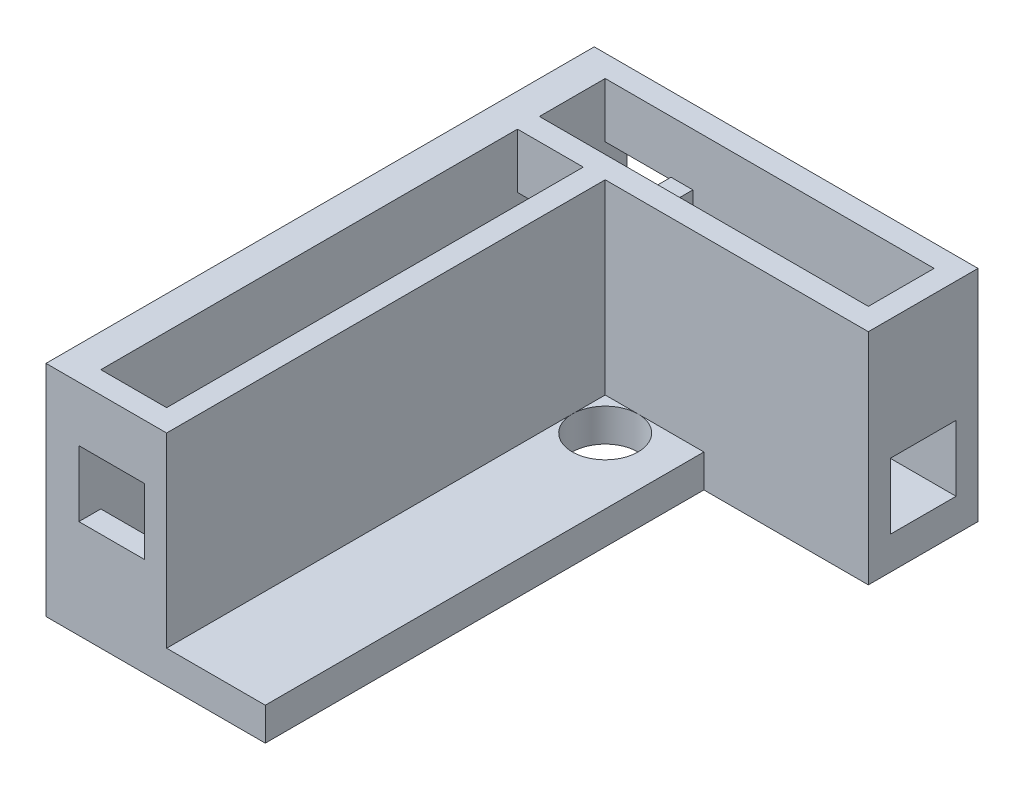
ISO-10303-21;
HEADER;
FILE_DESCRIPTION(('STEP AP214'),'2;1');
FILE_NAME('part.step','',(''),(''),'','','');
FILE_SCHEMA(('AUTOMOTIVE_DESIGN { 1 0 10303 214 1 1 1 1 }'));
ENDSEC;
DATA;
#1=APPLICATION_CONTEXT('core data for automotive mechanical design processes');
#2=APPLICATION_PROTOCOL_DEFINITION('international standard','automotive_design',2000,#1);
#3=PRODUCT_CONTEXT('',#1,'mechanical');
#4=PRODUCT('Part','Part','',(#3));
#5=PRODUCT_RELATED_PRODUCT_CATEGORY('part','',(#4));
#6=PRODUCT_DEFINITION_FORMATION('','',#4);
#7=PRODUCT_DEFINITION_CONTEXT('part definition',#1,'design');
#8=PRODUCT_DEFINITION('design','',#6,#7);
#9=PRODUCT_DEFINITION_SHAPE('','',#8);
#10=(LENGTH_UNIT() NAMED_UNIT(*) SI_UNIT(.MILLI.,.METRE.));
#11=(NAMED_UNIT(*) PLANE_ANGLE_UNIT() SI_UNIT($,.RADIAN.));
#12=(NAMED_UNIT(*) SI_UNIT($,.STERADIAN.) SOLID_ANGLE_UNIT());
#13=UNCERTAINTY_MEASURE_WITH_UNIT(LENGTH_MEASURE(1.E-05),#10,'distance_accuracy_value','');
#14=(GEOMETRIC_REPRESENTATION_CONTEXT(3) GLOBAL_UNCERTAINTY_ASSIGNED_CONTEXT((#13)) GLOBAL_UNIT_ASSIGNED_CONTEXT((#10,
#11,#12)) REPRESENTATION_CONTEXT('',''));
#15=CARTESIAN_POINT('',(0.,0.,0.));
#16=DIRECTION('',(0.,0.,1.));
#17=DIRECTION('',(1.,0.,0.));
#18=AXIS2_PLACEMENT_3D('',#15,#16,#17);
#19=CARTESIAN_POINT('',(35.,2.,10.));
#20=DIRECTION('',(0.,-1.,0.));
#21=DIRECTION('',(0.,0.,1.));
#22=AXIS2_PLACEMENT_3D('',#19,#20,#21);
#23=PLANE('',#22);
#24=DIRECTION('',(1.,0.,0.));
#25=VECTOR('',#24,1.);
#26=CARTESIAN_POINT('',(35.,2.,10.));
#27=LINE('',#26,#25);
#28=CARTESIAN_POINT('',(11.,2.,10.));
#29=VERTEX_POINT('',#28);
#30=CARTESIAN_POINT('',(14.,2.,10.));
#31=VERTEX_POINT('',#30);
#32=EDGE_CURVE('E287',#29,#31,#27,.T.);
#33=ORIENTED_EDGE('',*,*,#32,.F.);
#34=DIRECTION('',(0.,0.,-1.));
#35=VECTOR('',#34,1.);
#36=CARTESIAN_POINT('',(11.,2.,10.));
#37=LINE('',#36,#35);
#38=CARTESIAN_POINT('',(11.,2.,13.));
#39=VERTEX_POINT('',#38);
#40=EDGE_CURVE('E277',#39,#29,#37,.T.);
#41=ORIENTED_EDGE('',*,*,#40,.F.);
#42=CARTESIAN_POINT('',(14.,2.,13.));
#43=DIRECTION('',(0.,-1.,0.));
#44=DIRECTION('',(0.,0.,-1.));
#45=AXIS2_PLACEMENT_3D('',#42,#43,#44);
#46=CIRCLE('',#45,3.);
#47=EDGE_CURVE('E270',#39,#31,#46,.T.);
#48=ORIENTED_EDGE('',*,*,#47,.T.);
#49=EDGE_LOOP('',(#33,#41,#48));
#50=FACE_BOUND('',#49,.T.);
#51=ADVANCED_FACE('F34',(#50),#23,.F.);
#52=CARTESIAN_POINT('',(3.00000000000001,8.,19.3532580399902));
#53=DIRECTION('',(1.,0.,0.));
#54=DIRECTION('',(0.,0.,1.));
#55=AXIS2_PLACEMENT_3D('',#52,#53,#54);
#56=PLANE('',#55);
#57=DIRECTION('',(0.,-1.,0.));
#58=VECTOR('',#57,1.);
#59=CARTESIAN_POINT('',(3.00000000000001,14.2,50.));
#60=LINE('',#59,#58);
#61=CARTESIAN_POINT('',(3.00000000000001,14.,50.));
#62=VERTEX_POINT('',#61);
#63=CARTESIAN_POINT('',(3.00000000000001,8.,50.));
#64=VERTEX_POINT('',#63);
#65=EDGE_CURVE('E530',#62,#64,#60,.T.);
#66=ORIENTED_EDGE('',*,*,#65,.T.);
#67=DIRECTION('',(0.,0.,-1.));
#68=VECTOR('',#67,1.);
#69=CARTESIAN_POINT('',(3.00000000000001,8.,19.3532580399902));
#70=LINE('',#69,#68);
#71=CARTESIAN_POINT('',(3.00000000000001,8.,48.));
#72=VERTEX_POINT('',#71);
#73=EDGE_CURVE('E520',#64,#72,#70,.T.);
#74=ORIENTED_EDGE('',*,*,#73,.T.);
#75=DIRECTION('',(0.,-1.,0.));
#76=VECTOR('',#75,1.);
#77=CARTESIAN_POINT('',(3.00000000000001,8.,48.));
#78=LINE('',#77,#76);
#79=CARTESIAN_POINT('',(3.00000000000001,2.,48.));
#80=VERTEX_POINT('',#79);
#81=EDGE_CURVE('E422',#72,#80,#78,.T.);
#82=ORIENTED_EDGE('',*,*,#81,.T.);
#83=DIRECTION('',(0.,0.,-1.));
#84=VECTOR('',#83,1.);
#85=CARTESIAN_POINT('',(3.00000000000001,2.,10.));
#86=LINE('',#85,#84);
#87=CARTESIAN_POINT('',(3.00000000000001,2.,10.));
#88=VERTEX_POINT('',#87);
#89=EDGE_CURVE('E294',#80,#88,#86,.T.);
#90=ORIENTED_EDGE('',*,*,#89,.T.);
#91=DIRECTION('',(0.,-1.,0.));
#92=VECTOR('',#91,1.);
#93=CARTESIAN_POINT('',(3.00000000000001,8.,10.));
#94=LINE('',#93,#92);
#95=CARTESIAN_POINT('',(3.00000000000001,8.,10.));
#96=VERTEX_POINT('',#95);
#97=EDGE_CURVE('E288',#96,#88,#94,.T.);
#98=ORIENTED_EDGE('',*,*,#97,.F.);
#99=CARTESIAN_POINT('',(3.00000000000001,8.,8.));
#100=VERTEX_POINT('',#99);
#101=EDGE_CURVE('E523',#96,#100,#70,.T.);
#102=ORIENTED_EDGE('',*,*,#101,.T.);
#103=CARTESIAN_POINT('',(3.00000000000001,8.,1.99999999999999));
#104=VERTEX_POINT('',#103);
#105=EDGE_CURVE('E566',#100,#104,#70,.T.);
#106=ORIENTED_EDGE('',*,*,#105,.T.);
#107=CARTESIAN_POINT('',(3.00000000000001,8.,0.));
#108=VERTEX_POINT('',#107);
#109=EDGE_CURVE('E524',#104,#108,#70,.T.);
#110=ORIENTED_EDGE('',*,*,#109,.T.);
#111=DIRECTION('',(0.,-1.,0.));
#112=VECTOR('',#111,1.);
#113=CARTESIAN_POINT('',(3.00000000000001,14.2,0.));
#114=LINE('',#113,#112);
#115=CARTESIAN_POINT('',(3.00000000000001,14.,0.));
#116=VERTEX_POINT('',#115);
#117=EDGE_CURVE('E527',#116,#108,#114,.T.);
#118=ORIENTED_EDGE('',*,*,#117,.F.);
#119=DIRECTION('',(0.,0.,-1.));
#120=VECTOR('',#119,1.);
#121=CARTESIAN_POINT('',(3.00000000000001,14.,19.3532580399902));
#122=LINE('',#121,#120);
#123=CARTESIAN_POINT('',(3.00000000000001,14.,2.));
#124=VERTEX_POINT('',#123);
#125=EDGE_CURVE('E515',#124,#116,#122,.T.);
#126=ORIENTED_EDGE('',*,*,#125,.F.);
#127=DIRECTION('',(0.,-1.,0.));
#128=VECTOR('',#127,1.);
#129=CARTESIAN_POINT('',(3.00000000000001,19.,2.));
#130=LINE('',#129,#128);
#131=CARTESIAN_POINT('',(3.00000000000001,19.,2.));
#132=VERTEX_POINT('',#131);
#133=EDGE_CURVE('E490',#132,#124,#130,.T.);
#134=ORIENTED_EDGE('',*,*,#133,.F.);
#135=DIRECTION('',(0.,0.,-1.));
#136=VECTOR('',#135,1.);
#137=CARTESIAN_POINT('',(3.00000000000001,19.,19.3532580399902));
#138=LINE('',#137,#136);
#139=CARTESIAN_POINT('',(3.00000000000001,19.,8.));
#140=VERTEX_POINT('',#139);
#141=EDGE_CURVE('E463',#140,#132,#138,.T.);
#142=ORIENTED_EDGE('',*,*,#141,.F.);
#143=DIRECTION('',(0.,-1.,0.));
#144=VECTOR('',#143,1.);
#145=CARTESIAN_POINT('',(3.00000000000001,19.,8.));
#146=LINE('',#145,#144);
#147=CARTESIAN_POINT('',(3.00000000000001,14.,8.));
#148=VERTEX_POINT('',#147);
#149=EDGE_CURVE('E493',#140,#148,#146,.T.);
#150=ORIENTED_EDGE('',*,*,#149,.T.);
#151=CARTESIAN_POINT('',(3.00000000000001,14.,10.));
#152=VERTEX_POINT('',#151);
#153=EDGE_CURVE('E518',#152,#148,#122,.T.);
#154=ORIENTED_EDGE('',*,*,#153,.F.);
#155=DIRECTION('',(0.,-1.,0.));
#156=VECTOR('',#155,1.);
#157=CARTESIAN_POINT('',(3.00000000000001,19.,10.));
#158=LINE('',#157,#156);
#159=CARTESIAN_POINT('',(3.00000000000001,19.,10.));
#160=VERTEX_POINT('',#159);
#161=EDGE_CURVE('E477',#160,#152,#158,.T.);
#162=ORIENTED_EDGE('',*,*,#161,.F.);
#163=DIRECTION('',(0.,0.,-1.));
#164=VECTOR('',#163,1.);
#165=CARTESIAN_POINT('',(3.00000000000001,19.,19.3532580399902));
#166=LINE('',#165,#164);
#167=CARTESIAN_POINT('',(3.00000000000001,19.,48.));
#168=VERTEX_POINT('',#167);
#169=EDGE_CURVE('E489',#168,#160,#166,.T.);
#170=ORIENTED_EDGE('',*,*,#169,.F.);
#171=DIRECTION('',(0.,-1.,0.));
#172=VECTOR('',#171,1.);
#173=CARTESIAN_POINT('',(3.00000000000001,19.,48.));
#174=LINE('',#173,#172);
#175=CARTESIAN_POINT('',(3.00000000000001,14.,48.));
#176=VERTEX_POINT('',#175);
#177=EDGE_CURVE('E494',#168,#176,#174,.T.);
#178=ORIENTED_EDGE('',*,*,#177,.T.);
#179=EDGE_CURVE('E519',#62,#176,#122,.T.);
#180=ORIENTED_EDGE('',*,*,#179,.F.);
#181=EDGE_LOOP('',(#66,#74,#82,#90,#98,#102,#106,#110,#118,#126,#134,#142,#150,#154,#162,#170,
#178,#180));
#182=FACE_BOUND('',#181,.T.);
#183=ADVANCED_FACE('F434',(#182),#56,.T.);
#184=CARTESIAN_POINT('',(9.00000000000001,8.,19.3532580399902));
#185=DIRECTION('',(1.,0.,0.));
#186=DIRECTION('',(0.,0.,1.));
#187=AXIS2_PLACEMENT_3D('',#184,#185,#186);
#188=PLANE('',#187);
#189=DIRECTION('',(0.,0.,-1.));
#190=VECTOR('',#189,1.);
#191=CARTESIAN_POINT('',(9.00000000000001,14.2,19.3532580399902));
#192=LINE('',#191,#190);
#193=CARTESIAN_POINT('',(9.00000000000001,14.2,8.));
#194=VERTEX_POINT('',#193);
#195=CARTESIAN_POINT('',(9.00000000000001,14.2,2.));
#196=VERTEX_POINT('',#195);
#197=EDGE_CURVE('E383',#194,#196,#192,.T.);
#198=ORIENTED_EDGE('',*,*,#197,.T.);
#199=DIRECTION('',(0.,-1.,0.));
#200=VECTOR('',#199,1.);
#201=CARTESIAN_POINT('',(9.00000000000001,8.,1.99999999999999));
#202=LINE('',#201,#200);
#203=CARTESIAN_POINT('',(9.00000000000001,14.,2.));
#204=VERTEX_POINT('',#203);
#205=EDGE_CURVE('E378',#196,#204,#202,.T.);
#206=ORIENTED_EDGE('',*,*,#205,.T.);
#207=DIRECTION('',(0.,0.,-1.));
#208=VECTOR('',#207,1.);
#209=CARTESIAN_POINT('',(9.00000000000001,14.,19.3532580399902));
#210=LINE('',#209,#208);
#211=CARTESIAN_POINT('',(9.00000000000001,14.,0.));
#212=VERTEX_POINT('',#211);
#213=EDGE_CURVE('E510',#204,#212,#210,.T.);
#214=ORIENTED_EDGE('',*,*,#213,.T.);
#215=DIRECTION('',(0.,-1.,0.));
#216=VECTOR('',#215,1.);
#217=CARTESIAN_POINT('',(9.00000000000001,14.2,0.));
#218=LINE('',#217,#216);
#219=CARTESIAN_POINT('',(9.00000000000001,8.,0.));
#220=VERTEX_POINT('',#219);
#221=EDGE_CURVE('E404',#212,#220,#218,.T.);
#222=ORIENTED_EDGE('',*,*,#221,.T.);
#223=DIRECTION('',(0.,0.,-1.));
#224=VECTOR('',#223,1.);
#225=CARTESIAN_POINT('',(9.00000000000001,8.,19.3532580399902));
#226=LINE('',#225,#224);
#227=CARTESIAN_POINT('',(9.00000000000001,8.,2.));
#228=VERTEX_POINT('',#227);
#229=EDGE_CURVE('E543',#228,#220,#226,.T.);
#230=ORIENTED_EDGE('',*,*,#229,.F.);
#231=CARTESIAN_POINT('',(9.00000000000001,8.,8.));
#232=VERTEX_POINT('',#231);
#233=EDGE_CURVE('E655',#232,#228,#226,.T.);
#234=ORIENTED_EDGE('',*,*,#233,.F.);
#235=CARTESIAN_POINT('',(9.00000000000001,8.,10.));
#236=VERTEX_POINT('',#235);
#237=EDGE_CURVE('E546',#236,#232,#226,.T.);
#238=ORIENTED_EDGE('',*,*,#237,.F.);
#239=DIRECTION('',(0.,-1.,0.));
#240=VECTOR('',#239,1.);
#241=CARTESIAN_POINT('',(9.00000000000001,8.,10.));
#242=LINE('',#241,#240);
#243=CARTESIAN_POINT('',(9.00000000000001,2.,10.));
#244=VERTEX_POINT('',#243);
#245=EDGE_CURVE('E416',#236,#244,#242,.T.);
#246=ORIENTED_EDGE('',*,*,#245,.T.);
#247=DIRECTION('',(0.,0.,-1.));
#248=VECTOR('',#247,1.);
#249=CARTESIAN_POINT('',(9.00000000000001,2.,10.));
#250=LINE('',#249,#248);
#251=CARTESIAN_POINT('',(9.,2.,48.));
#252=VERTEX_POINT('',#251);
#253=EDGE_CURVE('E282',#252,#244,#250,.T.);
#254=ORIENTED_EDGE('',*,*,#253,.F.);
#255=DIRECTION('',(0.,-1.,0.));
#256=VECTOR('',#255,1.);
#257=CARTESIAN_POINT('',(9.00000000000001,8.,48.));
#258=LINE('',#257,#256);
#259=CARTESIAN_POINT('',(9.00000000000001,8.,48.));
#260=VERTEX_POINT('',#259);
#261=EDGE_CURVE('E419',#260,#252,#258,.T.);
#262=ORIENTED_EDGE('',*,*,#261,.F.);
#263=CARTESIAN_POINT('',(9.00000000000001,8.,50.));
#264=VERTEX_POINT('',#263);
#265=EDGE_CURVE('E388',#264,#260,#226,.T.);
#266=ORIENTED_EDGE('',*,*,#265,.F.);
#267=DIRECTION('',(0.,-1.,0.));
#268=VECTOR('',#267,1.);
#269=CARTESIAN_POINT('',(9.00000000000001,14.2,50.));
#270=LINE('',#269,#268);
#271=CARTESIAN_POINT('',(9.00000000000001,14.,50.));
#272=VERTEX_POINT('',#271);
#273=EDGE_CURVE('E408',#272,#264,#270,.T.);
#274=ORIENTED_EDGE('',*,*,#273,.F.);
#275=CARTESIAN_POINT('',(9.00000000000001,14.,48.));
#276=VERTEX_POINT('',#275);
#277=EDGE_CURVE('E514',#272,#276,#210,.T.);
#278=ORIENTED_EDGE('',*,*,#277,.T.);
#279=DIRECTION('',(0.,-1.,0.));
#280=VECTOR('',#279,1.);
#281=CARTESIAN_POINT('',(9.00000000000001,19.,48.));
#282=LINE('',#281,#280);
#283=CARTESIAN_POINT('',(9.00000000000001,19.,48.));
#284=VERTEX_POINT('',#283);
#285=EDGE_CURVE('E502',#284,#276,#282,.T.);
#286=ORIENTED_EDGE('',*,*,#285,.F.);
#287=DIRECTION('',(0.,0.,-1.));
#288=VECTOR('',#287,1.);
#289=CARTESIAN_POINT('',(9.00000000000001,19.,19.3532580399902));
#290=LINE('',#289,#288);
#291=CARTESIAN_POINT('',(9.00000000000001,19.,10.));
#292=VERTEX_POINT('',#291);
#293=EDGE_CURVE('E722',#284,#292,#290,.T.);
#294=ORIENTED_EDGE('',*,*,#293,.T.);
#295=DIRECTION('',(0.,-1.,0.));
#296=VECTOR('',#295,1.);
#297=CARTESIAN_POINT('',(9.00000000000001,19.,10.));
#298=LINE('',#297,#296);
#299=CARTESIAN_POINT('',(9.00000000000001,14.,10.));
#300=VERTEX_POINT('',#299);
#301=EDGE_CURVE('E499',#292,#300,#298,.T.);
#302=ORIENTED_EDGE('',*,*,#301,.T.);
#303=CARTESIAN_POINT('',(9.00000000000001,14.,8.));
#304=VERTEX_POINT('',#303);
#305=EDGE_CURVE('E513',#300,#304,#210,.T.);
#306=ORIENTED_EDGE('',*,*,#305,.T.);
#307=DIRECTION('',(0.,-1.,0.));
#308=VECTOR('',#307,1.);
#309=CARTESIAN_POINT('',(9.00000000000001,8.,8.));
#310=LINE('',#309,#308);
#311=EDGE_CURVE('E507',#194,#304,#310,.T.);
#312=ORIENTED_EDGE('',*,*,#311,.F.);
#313=EDGE_LOOP('',(#198,#206,#214,#222,#230,#234,#238,#246,#254,#262,#266,#274,#278,#286,#294,
#302,#306,#312));
#314=FACE_BOUND('',#313,.T.);
#315=ADVANCED_FACE('F559',(#314),#188,.F.);
#316=CARTESIAN_POINT('',(-55.6237513405793,8.,19.3532580399902));
#317=DIRECTION('',(0.,1.,0.));
#318=DIRECTION('',(0.,0.,-1.));
#319=AXIS2_PLACEMENT_3D('',#316,#317,#318);
#320=PLANE('',#319);
#321=ORIENTED_EDGE('',*,*,#101,.F.);
#322=DIRECTION('',(1.,0.,0.));
#323=VECTOR('',#322,1.);
#324=CARTESIAN_POINT('',(-55.6237513405793,8.,10.));
#325=LINE('',#324,#323);
#326=EDGE_CURVE('E301',#96,#236,#325,.T.);
#327=ORIENTED_EDGE('',*,*,#326,.T.);
#328=ORIENTED_EDGE('',*,*,#237,.T.);
#329=DIRECTION('',(-1.,0.,0.));
#330=VECTOR('',#329,1.);
#331=CARTESIAN_POINT('',(-55.6237513405793,8.,7.99999999999999));
#332=LINE('',#331,#330);
#333=EDGE_CURVE('E297',#232,#100,#332,.T.);
#334=ORIENTED_EDGE('',*,*,#333,.T.);
#335=EDGE_LOOP('',(#321,#327,#328,#334));
#336=FACE_BOUND('',#335,.T.);
#337=ADVANCED_FACE('F661',(#336),#320,.T.);
#338=CARTESIAN_POINT('',(-55.6237513405793,8.,19.3532580399902));
#339=DIRECTION('',(0.,1.,0.));
#340=DIRECTION('',(0.,0.,-1.));
#341=AXIS2_PLACEMENT_3D('',#338,#339,#340);
#342=PLANE('',#341);
#343=ORIENTED_EDGE('',*,*,#109,.F.);
#344=DIRECTION('',(-1.,0.,0.));
#345=VECTOR('',#344,1.);
#346=CARTESIAN_POINT('',(-55.6237513405793,8.,1.99999999999999));
#347=LINE('',#346,#345);
#348=EDGE_CURVE('E314',#228,#104,#347,.T.);
#349=ORIENTED_EDGE('',*,*,#348,.F.);
#350=ORIENTED_EDGE('',*,*,#229,.T.);
#351=DIRECTION('',(1.,0.,0.));
#352=VECTOR('',#351,1.);
#353=CARTESIAN_POINT('',(-55.6237513405793,8.,0.));
#354=LINE('',#353,#352);
#355=EDGE_CURVE('E312',#108,#220,#354,.T.);
#356=ORIENTED_EDGE('',*,*,#355,.F.);
#357=EDGE_LOOP('',(#343,#349,#350,#356));
#358=FACE_BOUND('',#357,.T.);
#359=ADVANCED_FACE('F653',(#358),#342,.T.);
#360=ORIENTED_EDGE('',*,*,#73,.F.);
#361=DIRECTION('',(1.,0.,0.));
#362=VECTOR('',#361,1.);
#363=CARTESIAN_POINT('',(-55.6237513405793,8.,50.));
#364=LINE('',#363,#362);
#365=EDGE_CURVE('E410',#64,#264,#364,.T.);
#366=ORIENTED_EDGE('',*,*,#365,.T.);
#367=ORIENTED_EDGE('',*,*,#265,.T.);
#368=DIRECTION('',(1.,0.,0.));
#369=VECTOR('',#368,1.);
#370=CARTESIAN_POINT('',(-55.6237513405793,8.,48.));
#371=LINE('',#370,#369);
#372=EDGE_CURVE('E412',#72,#260,#371,.T.);
#373=ORIENTED_EDGE('',*,*,#372,.F.);
#374=EDGE_LOOP('',(#360,#366,#367,#373));
#375=FACE_BOUND('',#374,.T.);
#376=ADVANCED_FACE('F561',(#375),#320,.T.);
#377=CARTESIAN_POINT('',(11.,2.,50.));
#378=VERTEX_POINT('',#377);
#379=EDGE_CURVE('E265',#378,#39,#37,.T.);
#380=ORIENTED_EDGE('',*,*,#379,.F.);
#381=DIRECTION('',(1.,0.,0.));
#382=VECTOR('',#381,1.);
#383=CARTESIAN_POINT('',(0.,2.,50.));
#384=LINE('',#383,#382);
#385=CARTESIAN_POINT('',(20.,2.,50.));
#386=VERTEX_POINT('',#385);
#387=EDGE_CURVE('E328',#378,#386,#384,.T.);
#388=ORIENTED_EDGE('',*,*,#387,.T.);
#389=DIRECTION('',(0.,0.,-1.));
#390=VECTOR('',#389,1.);
#391=CARTESIAN_POINT('',(20.,2.,50.));
#392=LINE('',#391,#390);
#393=CARTESIAN_POINT('',(20.,2.,10.));
#394=VERTEX_POINT('',#393);
#395=EDGE_CURVE('E330',#386,#394,#392,.T.);
#396=ORIENTED_EDGE('',*,*,#395,.T.);
#397=EDGE_CURVE('E268',#31,#394,#27,.T.);
#398=ORIENTED_EDGE('',*,*,#397,.F.);
#399=EDGE_CURVE('E49',#31,#39,#46,.T.);
#400=ORIENTED_EDGE('',*,*,#399,.T.);
#401=EDGE_LOOP('',(#380,#388,#396,#398,#400));
#402=FACE_BOUND('',#401,.T.);
#403=ADVANCED_FACE('F263',(#402),#23,.F.);
#404=CARTESIAN_POINT('',(20.,-1.,10.));
#405=DIRECTION('',(0.,0.,-1.));
#406=DIRECTION('',(1.,0.,0.));
#407=AXIS2_PLACEMENT_3D('',#404,#405,#406);
#408=PLANE('',#407);
#409=EDGE_CURVE('E308',#88,#244,#27,.T.);
#410=ORIENTED_EDGE('',*,*,#409,.T.);
#411=ORIENTED_EDGE('',*,*,#245,.F.);
#412=ORIENTED_EDGE('',*,*,#326,.F.);
#413=ORIENTED_EDGE('',*,*,#97,.T.);
#414=EDGE_LOOP('',(#410,#411,#412,#413));
#415=FACE_BOUND('',#414,.T.);
#416=ADVANCED_FACE('F427',(#415),#408,.F.);
#417=DIRECTION('',(0.,0.,-1.));
#418=VECTOR('',#417,1.);
#419=CARTESIAN_POINT('',(35.,2.,10.));
#420=LINE('',#419,#418);
#421=CARTESIAN_POINT('',(35.,2.,8.));
#422=VERTEX_POINT('',#421);
#423=CARTESIAN_POINT('',(35.,2.,2.));
#424=VERTEX_POINT('',#423);
#425=EDGE_CURVE('E322',#422,#424,#420,.T.);
#426=ORIENTED_EDGE('',*,*,#425,.T.);
#427=DIRECTION('',(-1.,0.,0.));
#428=VECTOR('',#427,1.);
#429=CARTESIAN_POINT('',(35.,2.,2.));
#430=LINE('',#429,#428);
#431=CARTESIAN_POINT('',(0.,2.,1.99999999999999));
#432=VERTEX_POINT('',#431);
#433=EDGE_CURVE('E364',#424,#432,#430,.T.);
#434=ORIENTED_EDGE('',*,*,#433,.T.);
#435=DIRECTION('',(0.,0.,1.));
#436=VECTOR('',#435,1.);
#437=CARTESIAN_POINT('',(0.,2.,0.));
#438=LINE('',#437,#436);
#439=CARTESIAN_POINT('',(0.,2.,8.));
#440=VERTEX_POINT('',#439);
#441=EDGE_CURVE('E325',#432,#440,#438,.T.);
#442=ORIENTED_EDGE('',*,*,#441,.T.);
#443=DIRECTION('',(-1.,0.,0.));
#444=VECTOR('',#443,1.);
#445=CARTESIAN_POINT('',(35.,2.,8.));
#446=LINE('',#445,#444);
#447=EDGE_CURVE('E309',#422,#440,#446,.T.);
#448=ORIENTED_EDGE('',*,*,#447,.F.);
#449=EDGE_LOOP('',(#426,#434,#442,#448));
#450=FACE_BOUND('',#449,.T.);
#451=ADVANCED_FACE('F609',(#450),#23,.F.);
#452=DIRECTION('',(1.,0.,0.));
#453=VECTOR('',#452,1.);
#454=CARTESIAN_POINT('',(35.,2.,48.));
#455=LINE('',#454,#453);
#456=EDGE_CURVE('E367',#80,#252,#455,.T.);
#457=ORIENTED_EDGE('',*,*,#456,.T.);
#458=ORIENTED_EDGE('',*,*,#253,.T.);
#459=ORIENTED_EDGE('',*,*,#409,.F.);
#460=ORIENTED_EDGE('',*,*,#89,.F.);
#461=EDGE_LOOP('',(#457,#458,#459,#460));
#462=FACE_BOUND('',#461,.T.);
#463=ADVANCED_FACE('F438',(#462),#23,.F.);
#464=DIRECTION('',(1.,0.,0.));
#465=VECTOR('',#464,1.);
#466=CARTESIAN_POINT('',(-55.6237513405793,19.,10.));
#467=LINE('',#466,#465);
#468=CARTESIAN_POINT('',(11.,19.,10.));
#469=VERTEX_POINT('',#468);
#470=CARTESIAN_POINT('',(35.,19.,10.));
#471=VERTEX_POINT('',#470);
#472=EDGE_CURVE('E452',#469,#471,#467,.T.);
#473=ORIENTED_EDGE('',*,*,#472,.F.);
#474=DIRECTION('',(0.,-1.,0.));
#475=VECTOR('',#474,1.);
#476=CARTESIAN_POINT('',(11.,8.,10.));
#477=LINE('',#476,#475);
#478=EDGE_CURVE('E414',#469,#29,#477,.T.);
#479=ORIENTED_EDGE('',*,*,#478,.T.);
#480=ORIENTED_EDGE('',*,*,#32,.T.);
#481=ORIENTED_EDGE('',*,*,#397,.T.);
#482=DIRECTION('',(0.,1.,0.));
#483=VECTOR('',#482,1.);
#484=CARTESIAN_POINT('',(20.,-1.,10.));
#485=LINE('',#484,#483);
#486=CARTESIAN_POINT('',(20.,-1.,10.));
#487=VERTEX_POINT('',#486);
#488=EDGE_CURVE('E348',#487,#394,#485,.T.);
#489=ORIENTED_EDGE('',*,*,#488,.F.);
#490=DIRECTION('',(1.,0.,0.));
#491=VECTOR('',#490,1.);
#492=CARTESIAN_POINT('',(20.,-1.,10.));
#493=LINE('',#492,#491);
#494=CARTESIAN_POINT('',(35.,-1.,10.));
#495=VERTEX_POINT('',#494);
#496=EDGE_CURVE('E332',#487,#495,#493,.T.);
#497=ORIENTED_EDGE('',*,*,#496,.T.);
#498=DIRECTION('',(0.,1.,0.));
#499=VECTOR('',#498,1.);
#500=CARTESIAN_POINT('',(35.,-1.,10.));
#501=LINE('',#500,#499);
#502=EDGE_CURVE('E361',#495,#471,#501,.T.);
#503=ORIENTED_EDGE('',*,*,#502,.T.);
#504=EDGE_LOOP('',(#473,#479,#480,#481,#489,#497,#503));
#505=FACE_BOUND('',#504,.T.);
#506=ADVANCED_FACE('F36',(#505),#408,.F.);
#507=CARTESIAN_POINT('',(35.,-1.,10.));
#508=DIRECTION('',(-1.,0.,0.));
#509=DIRECTION('',(0.,0.,-1.));
#510=AXIS2_PLACEMENT_3D('',#507,#508,#509);
#511=PLANE('',#510);
#512=DIRECTION('',(0.,0.,-1.));
#513=VECTOR('',#512,1.);
#514=CARTESIAN_POINT('',(35.,19.,19.3532580399902));
#515=LINE('',#514,#513);
#516=CARTESIAN_POINT('',(35.,19.,0.));
#517=VERTEX_POINT('',#516);
#518=EDGE_CURVE('E460',#471,#517,#515,.T.);
#519=ORIENTED_EDGE('',*,*,#518,.F.);
#520=ORIENTED_EDGE('',*,*,#502,.F.);
#521=DIRECTION('',(0.,0.,-1.));
#522=VECTOR('',#521,1.);
#523=CARTESIAN_POINT('',(35.,-1.,10.));
#524=LINE('',#523,#522);
#525=CARTESIAN_POINT('',(35.,-1.,0.));
#526=VERTEX_POINT('',#525);
#527=EDGE_CURVE('E335',#495,#526,#524,.T.);
#528=ORIENTED_EDGE('',*,*,#527,.T.);
#529=DIRECTION('',(0.,1.,0.));
#530=VECTOR('',#529,1.);
#531=CARTESIAN_POINT('',(35.,-1.,0.));
#532=LINE('',#531,#530);
#533=EDGE_CURVE('E358',#526,#517,#532,.T.);
#534=ORIENTED_EDGE('',*,*,#533,.T.);
#535=EDGE_LOOP('',(#519,#520,#528,#534));
#536=FACE_BOUND('',#535,.T.);
#537=DIRECTION('',(0.,-1.,0.));
#538=VECTOR('',#537,1.);
#539=CARTESIAN_POINT('',(35.,8.,2.));
#540=LINE('',#539,#538);
#541=CARTESIAN_POINT('',(35.,8.,2.));
#542=VERTEX_POINT('',#541);
#543=EDGE_CURVE('E320',#542,#424,#540,.T.);
#544=ORIENTED_EDGE('',*,*,#543,.T.);
#545=ORIENTED_EDGE('',*,*,#425,.F.);
#546=DIRECTION('',(0.,-1.,0.));
#547=VECTOR('',#546,1.);
#548=CARTESIAN_POINT('',(35.,8.,8.));
#549=LINE('',#548,#547);
#550=CARTESIAN_POINT('',(35.,8.,8.));
#551=VERTEX_POINT('',#550);
#552=EDGE_CURVE('E305',#551,#422,#549,.T.);
#553=ORIENTED_EDGE('',*,*,#552,.F.);
#554=DIRECTION('',(0.,0.,-1.));
#555=VECTOR('',#554,1.);
#556=CARTESIAN_POINT('',(35.,8.,19.3532580399902));
#557=LINE('',#556,#555);
#558=EDGE_CURVE('E540',#551,#542,#557,.T.);
#559=ORIENTED_EDGE('',*,*,#558,.T.);
#560=EDGE_LOOP('',(#544,#545,#553,#559));
#561=FACE_BOUND('',#560,.T.);
#562=ADVANCED_FACE('F615',(#536,#561),#511,.F.);
#563=CARTESIAN_POINT('',(0.,-1.,0.));
#564=DIRECTION('',(0.,0.,-1.));
#565=DIRECTION('',(1.,0.,0.));
#566=AXIS2_PLACEMENT_3D('',#563,#564,#565);
#567=PLANE('',#566);
#568=DIRECTION('',(1.,0.,0.));
#569=VECTOR('',#568,1.);
#570=CARTESIAN_POINT('',(-55.6237513405793,14.,0.));
#571=LINE('',#570,#569);
#572=EDGE_CURVE('E483',#116,#212,#571,.T.);
#573=ORIENTED_EDGE('',*,*,#572,.F.);
#574=ORIENTED_EDGE('',*,*,#117,.T.);
#575=ORIENTED_EDGE('',*,*,#355,.T.);
#576=ORIENTED_EDGE('',*,*,#221,.F.);
#577=EDGE_LOOP('',(#573,#574,#575,#576));
#578=FACE_BOUND('',#577,.T.);
#579=DIRECTION('',(1.,0.,0.));
#580=VECTOR('',#579,1.);
#581=CARTESIAN_POINT('',(-55.6237513405793,19.,0.));
#582=LINE('',#581,#580);
#583=CARTESIAN_POINT('',(0.,19.,0.));
#584=VERTEX_POINT('',#583);
#585=EDGE_CURVE('E465',#584,#517,#582,.T.);
#586=ORIENTED_EDGE('',*,*,#585,.T.);
#587=ORIENTED_EDGE('',*,*,#533,.F.);
#588=DIRECTION('',(1.,0.,0.));
#589=VECTOR('',#588,1.);
#590=CARTESIAN_POINT('',(0.,-1.,0.));
#591=LINE('',#590,#589);
#592=CARTESIAN_POINT('',(0.,-1.,0.));
#593=VERTEX_POINT('',#592);
#594=EDGE_CURVE('E338',#593,#526,#591,.T.);
#595=ORIENTED_EDGE('',*,*,#594,.F.);
#596=DIRECTION('',(0.,1.,0.));
#597=VECTOR('',#596,1.);
#598=CARTESIAN_POINT('',(0.,-1.,0.));
#599=LINE('',#598,#597);
#600=EDGE_CURVE('E355',#593,#584,#599,.T.);
#601=ORIENTED_EDGE('',*,*,#600,.T.);
#602=EDGE_LOOP('',(#586,#587,#595,#601));
#603=FACE_BOUND('',#602,.T.);
#604=ADVANCED_FACE('F648',(#578,#603),#567,.T.);
#605=CARTESIAN_POINT('',(0.,-1.,0.));
#606=DIRECTION('',(1.,0.,0.));
#607=DIRECTION('',(0.,0.,1.));
#608=AXIS2_PLACEMENT_3D('',#605,#606,#607);
#609=PLANE('',#608);
#610=DIRECTION('',(0.,0.,1.));
#611=VECTOR('',#610,1.);
#612=CARTESIAN_POINT('',(0.,19.,19.3532580399902));
#613=LINE('',#612,#611);
#614=CARTESIAN_POINT('',(0.,19.,50.));
#615=VERTEX_POINT('',#614);
#616=EDGE_CURVE('E715',#584,#615,#613,.T.);
#617=ORIENTED_EDGE('',*,*,#616,.F.);
#618=ORIENTED_EDGE('',*,*,#600,.F.);
#619=DIRECTION('',(0.,0.,1.));
#620=VECTOR('',#619,1.);
#621=CARTESIAN_POINT('',(0.,-1.,0.));
#622=LINE('',#621,#620);
#623=CARTESIAN_POINT('',(0.,-1.,50.));
#624=VERTEX_POINT('',#623);
#625=EDGE_CURVE('E340',#593,#624,#622,.T.);
#626=ORIENTED_EDGE('',*,*,#625,.T.);
#627=DIRECTION('',(0.,1.,0.));
#628=VECTOR('',#627,1.);
#629=CARTESIAN_POINT('',(0.,-1.,50.));
#630=LINE('',#629,#628);
#631=EDGE_CURVE('E352',#624,#615,#630,.T.);
#632=ORIENTED_EDGE('',*,*,#631,.T.);
#633=EDGE_LOOP('',(#617,#618,#626,#632));
#634=FACE_BOUND('',#633,.T.);
#635=DIRECTION('',(0.,-1.,0.));
#636=VECTOR('',#635,1.);
#637=CARTESIAN_POINT('',(0.,8.,8.));
#638=LINE('',#637,#636);
#639=CARTESIAN_POINT('',(0.,8.,8.));
#640=VERTEX_POINT('',#639);
#641=EDGE_CURVE('E303',#640,#440,#638,.T.);
#642=ORIENTED_EDGE('',*,*,#641,.T.);
#643=ORIENTED_EDGE('',*,*,#441,.F.);
#644=DIRECTION('',(0.,-1.,0.));
#645=VECTOR('',#644,1.);
#646=CARTESIAN_POINT('',(0.,8.,1.99999999999999));
#647=LINE('',#646,#645);
#648=CARTESIAN_POINT('',(0.,8.,1.99999999999999));
#649=VERTEX_POINT('',#648);
#650=EDGE_CURVE('E318',#649,#432,#647,.T.);
#651=ORIENTED_EDGE('',*,*,#650,.F.);
#652=DIRECTION('',(0.,0.,1.));
#653=VECTOR('',#652,1.);
#654=CARTESIAN_POINT('',(0.,8.,19.3532580399902));
#655=LINE('',#654,#653);
#656=EDGE_CURVE('E522',#649,#640,#655,.T.);
#657=ORIENTED_EDGE('',*,*,#656,.T.);
#658=EDGE_LOOP('',(#642,#643,#651,#657));
#659=FACE_BOUND('',#658,.T.);
#660=ADVANCED_FACE('F632',(#634,#659),#609,.F.);
#661=CARTESIAN_POINT('',(0.,-1.,50.));
#662=DIRECTION('',(0.,0.,-1.));
#663=DIRECTION('',(1.,0.,0.));
#664=AXIS2_PLACEMENT_3D('',#661,#662,#663);
#665=PLANE('',#664);
#666=ORIENTED_EDGE('',*,*,#273,.T.);
#667=ORIENTED_EDGE('',*,*,#365,.F.);
#668=ORIENTED_EDGE('',*,*,#65,.F.);
#669=DIRECTION('',(1.,0.,0.));
#670=VECTOR('',#669,1.);
#671=CARTESIAN_POINT('',(-55.6237513405793,14.,50.));
#672=LINE('',#671,#670);
#673=EDGE_CURVE('E481',#62,#272,#672,.T.);
#674=ORIENTED_EDGE('',*,*,#673,.T.);
#675=EDGE_LOOP('',(#666,#667,#668,#674));
#676=FACE_BOUND('',#675,.T.);
#677=DIRECTION('',(0.,-1.,0.));
#678=VECTOR('',#677,1.);
#679=CARTESIAN_POINT('',(11.,8.,50.));
#680=LINE('',#679,#678);
#681=CARTESIAN_POINT('',(11.,19.,50.));
#682=VERTEX_POINT('',#681);
#683=EDGE_CURVE('E280',#682,#378,#680,.T.);
#684=ORIENTED_EDGE('',*,*,#683,.F.);
#685=DIRECTION('',(1.,0.,0.));
#686=VECTOR('',#685,1.);
#687=CARTESIAN_POINT('',(-55.6237513405793,19.,50.));
#688=LINE('',#687,#686);
#689=EDGE_CURVE('E716',#615,#682,#688,.T.);
#690=ORIENTED_EDGE('',*,*,#689,.F.);
#691=ORIENTED_EDGE('',*,*,#631,.F.);
#692=DIRECTION('',(1.,0.,0.));
#693=VECTOR('',#692,1.);
#694=CARTESIAN_POINT('',(0.,-1.,50.));
#695=LINE('',#694,#693);
#696=CARTESIAN_POINT('',(20.,-1.,50.));
#697=VERTEX_POINT('',#696);
#698=EDGE_CURVE('E343',#624,#697,#695,.T.);
#699=ORIENTED_EDGE('',*,*,#698,.T.);
#700=DIRECTION('',(0.,1.,0.));
#701=VECTOR('',#700,1.);
#702=CARTESIAN_POINT('',(20.,-1.,50.));
#703=LINE('',#702,#701);
#704=EDGE_CURVE('E350',#697,#386,#703,.T.);
#705=ORIENTED_EDGE('',*,*,#704,.T.);
#706=ORIENTED_EDGE('',*,*,#387,.F.);
#707=EDGE_LOOP('',(#684,#690,#691,#699,#705,#706));
#708=FACE_BOUND('',#707,.T.);
#709=ADVANCED_FACE('F552',(#676,#708),#665,.F.);
#710=CARTESIAN_POINT('',(20.,-1.,50.));
#711=DIRECTION('',(-1.,0.,0.));
#712=DIRECTION('',(0.,0.,-1.));
#713=AXIS2_PLACEMENT_3D('',#710,#711,#712);
#714=PLANE('',#713);
#715=ORIENTED_EDGE('',*,*,#704,.F.);
#716=DIRECTION('',(0.,0.,-1.));
#717=VECTOR('',#716,1.);
#718=CARTESIAN_POINT('',(20.,-1.,50.));
#719=LINE('',#718,#717);
#720=EDGE_CURVE('E346',#697,#487,#719,.T.);
#721=ORIENTED_EDGE('',*,*,#720,.T.);
#722=ORIENTED_EDGE('',*,*,#488,.T.);
#723=ORIENTED_EDGE('',*,*,#395,.F.);
#724=EDGE_LOOP('',(#715,#721,#722,#723));
#725=FACE_BOUND('',#724,.T.);
#726=ADVANCED_FACE('F446',(#725),#714,.F.);
#727=CARTESIAN_POINT('',(35.,-1.,10.));
#728=DIRECTION('',(0.,-1.,0.));
#729=DIRECTION('',(0.,0.,1.));
#730=AXIS2_PLACEMENT_3D('',#727,#728,#729);
#731=PLANE('',#730);
#732=CARTESIAN_POINT('',(14.,-1.,13.));
#733=DIRECTION('',(0.,1.,0.));
#734=DIRECTION('',(0.,0.,1.));
#735=AXIS2_PLACEMENT_3D('',#732,#733,#734);
#736=CIRCLE('',#735,3.);
#737=CARTESIAN_POINT('',(14.,-1.,16.));
#738=VERTEX_POINT('',#737);
#739=EDGE_CURVE('E38',#738,#738,#736,.T.);
#740=ORIENTED_EDGE('',*,*,#739,.T.);
#741=EDGE_LOOP('',(#740));
#742=FACE_BOUND('',#741,.T.);
#743=ORIENTED_EDGE('',*,*,#496,.F.);
#744=ORIENTED_EDGE('',*,*,#720,.F.);
#745=ORIENTED_EDGE('',*,*,#698,.F.);
#746=ORIENTED_EDGE('',*,*,#625,.F.);
#747=ORIENTED_EDGE('',*,*,#594,.T.);
#748=ORIENTED_EDGE('',*,*,#527,.F.);
#749=EDGE_LOOP('',(#743,#744,#745,#746,#747,#748));
#750=FACE_BOUND('',#749,.T.);
#751=ADVANCED_FACE('F449',(#742,#750),#731,.T.);
#752=CARTESIAN_POINT('',(-55.6237513405793,8.,1.99999999999999));
#753=DIRECTION('',(0.,0.,-1.));
#754=DIRECTION('',(1.,0.,0.));
#755=AXIS2_PLACEMENT_3D('',#752,#753,#754);
#756=PLANE('',#755);
#757=DIRECTION('',(0.,-1.,0.));
#758=VECTOR('',#757,1.);
#759=CARTESIAN_POINT('',(33.,14.2,2.));
#760=LINE('',#759,#758);
#761=CARTESIAN_POINT('',(33.,19.,2.));
#762=VERTEX_POINT('',#761);
#763=CARTESIAN_POINT('',(33.,8.,2.));
#764=VERTEX_POINT('',#763);
#765=EDGE_CURVE('E393',#762,#764,#760,.T.);
#766=ORIENTED_EDGE('',*,*,#765,.F.);
#767=DIRECTION('',(-1.,0.,0.));
#768=VECTOR('',#767,1.);
#769=CARTESIAN_POINT('',(-55.6237513405793,19.,1.99999999999999));
#770=LINE('',#769,#768);
#771=EDGE_CURVE('E475',#762,#132,#770,.T.);
#772=ORIENTED_EDGE('',*,*,#771,.T.);
#773=ORIENTED_EDGE('',*,*,#133,.T.);
#774=DIRECTION('',(-1.,0.,0.));
#775=VECTOR('',#774,1.);
#776=CARTESIAN_POINT('',(-55.6237513405793,14.,1.99999999999999));
#777=LINE('',#776,#775);
#778=EDGE_CURVE('E487',#204,#124,#777,.T.);
#779=ORIENTED_EDGE('',*,*,#778,.F.);
#780=ORIENTED_EDGE('',*,*,#205,.F.);
#781=DIRECTION('',(1.,0.,0.));
#782=VECTOR('',#781,1.);
#783=CARTESIAN_POINT('',(-55.6237513405793,14.2,1.99999999999999));
#784=LINE('',#783,#782);
#785=CARTESIAN_POINT('',(11.,14.2,2.));
#786=VERTEX_POINT('',#785);
#787=EDGE_CURVE('E43',#196,#786,#784,.T.);
#788=ORIENTED_EDGE('',*,*,#787,.T.);
#789=DIRECTION('',(0.,-1.,0.));
#790=VECTOR('',#789,1.);
#791=CARTESIAN_POINT('',(11.,14.2,2.));
#792=LINE('',#791,#790);
#793=CARTESIAN_POINT('',(11.,8.,2.));
#794=VERTEX_POINT('',#793);
#795=EDGE_CURVE('E376',#786,#794,#792,.T.);
#796=ORIENTED_EDGE('',*,*,#795,.T.);
#797=DIRECTION('',(-1.,0.,0.));
#798=VECTOR('',#797,1.);
#799=CARTESIAN_POINT('',(-55.6237513405793,8.,1.99999999999999));
#800=LINE('',#799,#798);
#801=EDGE_CURVE('E407',#794,#228,#800,.T.);
#802=ORIENTED_EDGE('',*,*,#801,.T.);
#803=ORIENTED_EDGE('',*,*,#348,.T.);
#804=DIRECTION('',(-1.,0.,0.));
#805=VECTOR('',#804,1.);
#806=CARTESIAN_POINT('',(-55.6237513405793,8.,1.99999999999999));
#807=LINE('',#806,#805);
#808=EDGE_CURVE('E534',#104,#649,#807,.T.);
#809=ORIENTED_EDGE('',*,*,#808,.T.);
#810=ORIENTED_EDGE('',*,*,#650,.T.);
#811=ORIENTED_EDGE('',*,*,#433,.F.);
#812=ORIENTED_EDGE('',*,*,#543,.F.);
#813=EDGE_CURVE('E315',#542,#764,#347,.T.);
#814=ORIENTED_EDGE('',*,*,#813,.T.);
#815=EDGE_LOOP('',(#766,#772,#773,#779,#780,#788,#796,#802,#803,#809,#810,#811,#812,#814));
#816=FACE_BOUND('',#815,.T.);
#817=ADVANCED_FACE('F374',(#816),#756,.F.);
#818=CARTESIAN_POINT('',(-55.6237513405793,8.,7.99999999999999));
#819=DIRECTION('',(0.,0.,-1.));
#820=DIRECTION('',(1.,0.,0.));
#821=AXIS2_PLACEMENT_3D('',#818,#819,#820);
#822=PLANE('',#821);
#823=DIRECTION('',(0.,-1.,0.));
#824=VECTOR('',#823,1.);
#825=CARTESIAN_POINT('',(11.,14.2,8.));
#826=LINE('',#825,#824);
#827=CARTESIAN_POINT('',(11.,14.2,8.));
#828=VERTEX_POINT('',#827);
#829=CARTESIAN_POINT('',(11.,8.,8.));
#830=VERTEX_POINT('',#829);
#831=EDGE_CURVE('E394',#828,#830,#826,.T.);
#832=ORIENTED_EDGE('',*,*,#831,.F.);
#833=DIRECTION('',(1.,0.,0.));
#834=VECTOR('',#833,1.);
#835=CARTESIAN_POINT('',(-55.6237513405793,14.2,7.99999999999999));
#836=LINE('',#835,#834);
#837=EDGE_CURVE('E11',#194,#828,#836,.T.);
#838=ORIENTED_EDGE('',*,*,#837,.F.);
#839=ORIENTED_EDGE('',*,*,#311,.T.);
#840=DIRECTION('',(-1.,0.,0.));
#841=VECTOR('',#840,1.);
#842=CARTESIAN_POINT('',(-55.6237513405793,14.,7.99999999999999));
#843=LINE('',#842,#841);
#844=EDGE_CURVE('E485',#304,#148,#843,.T.);
#845=ORIENTED_EDGE('',*,*,#844,.T.);
#846=ORIENTED_EDGE('',*,*,#149,.F.);
#847=DIRECTION('',(-1.,0.,0.));
#848=VECTOR('',#847,1.);
#849=CARTESIAN_POINT('',(-55.6237513405793,19.,7.99999999999999));
#850=LINE('',#849,#848);
#851=CARTESIAN_POINT('',(33.,19.,8.));
#852=VERTEX_POINT('',#851);
#853=EDGE_CURVE('E471',#852,#140,#850,.T.);
#854=ORIENTED_EDGE('',*,*,#853,.F.);
#855=DIRECTION('',(0.,-1.,0.));
#856=VECTOR('',#855,1.);
#857=CARTESIAN_POINT('',(33.,14.2,8.));
#858=LINE('',#857,#856);
#859=CARTESIAN_POINT('',(33.,8.,8.));
#860=VERTEX_POINT('',#859);
#861=EDGE_CURVE('E397',#852,#860,#858,.T.);
#862=ORIENTED_EDGE('',*,*,#861,.T.);
#863=EDGE_CURVE('E298',#551,#860,#332,.T.);
#864=ORIENTED_EDGE('',*,*,#863,.F.);
#865=ORIENTED_EDGE('',*,*,#552,.T.);
#866=ORIENTED_EDGE('',*,*,#447,.T.);
#867=ORIENTED_EDGE('',*,*,#641,.F.);
#868=DIRECTION('',(-1.,0.,0.));
#869=VECTOR('',#868,1.);
#870=CARTESIAN_POINT('',(-55.6237513405793,8.,7.99999999999999));
#871=LINE('',#870,#869);
#872=EDGE_CURVE('E532',#100,#640,#871,.T.);
#873=ORIENTED_EDGE('',*,*,#872,.F.);
#874=ORIENTED_EDGE('',*,*,#333,.F.);
#875=DIRECTION('',(-1.,0.,0.));
#876=VECTOR('',#875,1.);
#877=CARTESIAN_POINT('',(-55.6237513405793,8.,7.99999999999999));
#878=LINE('',#877,#876);
#879=EDGE_CURVE('E405',#830,#232,#878,.T.);
#880=ORIENTED_EDGE('',*,*,#879,.F.);
#881=EDGE_LOOP('',(#832,#838,#839,#845,#846,#854,#862,#864,#865,#866,#867,#873,#874,#880));
#882=FACE_BOUND('',#881,.T.);
#883=ADVANCED_FACE('F578',(#882),#822,.T.);
#884=CARTESIAN_POINT('',(-55.6237513405793,8.,48.));
#885=DIRECTION('',(0.,0.,1.));
#886=DIRECTION('',(-1.,0.,0.));
#887=AXIS2_PLACEMENT_3D('',#884,#885,#886);
#888=PLANE('',#887);
#889=ORIENTED_EDGE('',*,*,#81,.F.);
#890=ORIENTED_EDGE('',*,*,#372,.T.);
#891=ORIENTED_EDGE('',*,*,#261,.T.);
#892=ORIENTED_EDGE('',*,*,#456,.F.);
#893=EDGE_LOOP('',(#889,#890,#891,#892));
#894=FACE_BOUND('',#893,.T.);
#895=ADVANCED_FACE('F680',(#894),#888,.F.);
#896=CARTESIAN_POINT('',(11.,8.,19.3532580399902));
#897=DIRECTION('',(1.,0.,0.));
#898=DIRECTION('',(0.,0.,1.));
#899=AXIS2_PLACEMENT_3D('',#896,#897,#898);
#900=PLANE('',#899);
#901=ORIENTED_EDGE('',*,*,#478,.F.);
#902=DIRECTION('',(0.,0.,-1.));
#903=VECTOR('',#902,1.);
#904=CARTESIAN_POINT('',(11.,19.,19.3532580399902));
#905=LINE('',#904,#903);
#906=EDGE_CURVE('E461',#682,#469,#905,.T.);
#907=ORIENTED_EDGE('',*,*,#906,.F.);
#908=ORIENTED_EDGE('',*,*,#683,.T.);
#909=ORIENTED_EDGE('',*,*,#379,.T.);
#910=ORIENTED_EDGE('',*,*,#40,.T.);
#911=EDGE_LOOP('',(#901,#907,#908,#909,#910));
#912=FACE_BOUND('',#911,.T.);
#913=ADVANCED_FACE('F275',(#912),#900,.T.);
#914=CARTESIAN_POINT('',(-55.6237513405793,8.,19.3532580399902));
#915=DIRECTION('',(0.,1.,0.));
#916=DIRECTION('',(0.,0.,-1.));
#917=AXIS2_PLACEMENT_3D('',#914,#915,#916);
#918=PLANE('',#917);
#919=ORIENTED_EDGE('',*,*,#558,.F.);
#920=ORIENTED_EDGE('',*,*,#863,.T.);
#921=DIRECTION('',(0.,0.,-1.));
#922=VECTOR('',#921,1.);
#923=CARTESIAN_POINT('',(33.,8.,19.3532580399902));
#924=LINE('',#923,#922);
#925=EDGE_CURVE('E535',#860,#764,#924,.T.);
#926=ORIENTED_EDGE('',*,*,#925,.T.);
#927=ORIENTED_EDGE('',*,*,#813,.F.);
#928=EDGE_LOOP('',(#919,#920,#926,#927));
#929=FACE_BOUND('',#928,.T.);
#930=ADVANCED_FACE('F636',(#929),#918,.F.);
#931=DIRECTION('',(0.,0.,-1.));
#932=VECTOR('',#931,1.);
#933=CARTESIAN_POINT('',(11.,8.,19.3532580399902));
#934=LINE('',#933,#932);
#935=EDGE_CURVE('E391',#830,#794,#934,.T.);
#936=ORIENTED_EDGE('',*,*,#935,.F.);
#937=ORIENTED_EDGE('',*,*,#879,.T.);
#938=ORIENTED_EDGE('',*,*,#233,.T.);
#939=ORIENTED_EDGE('',*,*,#801,.F.);
#940=EDGE_LOOP('',(#936,#937,#938,#939));
#941=FACE_BOUND('',#940,.T.);
#942=ADVANCED_FACE('F665',(#941),#918,.F.);
#943=CARTESIAN_POINT('',(33.,14.2,19.3532580399902));
#944=DIRECTION('',(1.,0.,0.));
#945=DIRECTION('',(0.,0.,1.));
#946=AXIS2_PLACEMENT_3D('',#943,#944,#945);
#947=PLANE('',#946);
#948=ORIENTED_EDGE('',*,*,#861,.F.);
#949=DIRECTION('',(0.,0.,-1.));
#950=VECTOR('',#949,1.);
#951=CARTESIAN_POINT('',(33.,19.,19.3532580399902));
#952=LINE('',#951,#950);
#953=EDGE_CURVE('E473',#852,#762,#952,.T.);
#954=ORIENTED_EDGE('',*,*,#953,.T.);
#955=ORIENTED_EDGE('',*,*,#765,.T.);
#956=ORIENTED_EDGE('',*,*,#925,.F.);
#957=EDGE_LOOP('',(#948,#954,#955,#956));
#958=FACE_BOUND('',#957,.T.);
#959=ADVANCED_FACE('F638',(#958),#947,.F.);
#960=CARTESIAN_POINT('',(11.,14.2,19.3532580399902));
#961=DIRECTION('',(1.,0.,0.));
#962=DIRECTION('',(0.,0.,1.));
#963=AXIS2_PLACEMENT_3D('',#960,#961,#962);
#964=PLANE('',#963);
#965=ORIENTED_EDGE('',*,*,#935,.T.);
#966=ORIENTED_EDGE('',*,*,#795,.F.);
#967=DIRECTION('',(0.,0.,-1.));
#968=VECTOR('',#967,1.);
#969=CARTESIAN_POINT('',(11.,14.2,19.3532580399902));
#970=LINE('',#969,#968);
#971=EDGE_CURVE('E384',#828,#786,#970,.T.);
#972=ORIENTED_EDGE('',*,*,#971,.F.);
#973=ORIENTED_EDGE('',*,*,#831,.T.);
#974=EDGE_LOOP('',(#965,#966,#972,#973));
#975=FACE_BOUND('',#974,.T.);
#976=ADVANCED_FACE('F390',(#975),#964,.T.);
#977=CARTESIAN_POINT('',(-55.6237513405793,14.2,19.3532580399902));
#978=DIRECTION('',(0.,1.,0.));
#979=DIRECTION('',(0.,0.,-1.));
#980=AXIS2_PLACEMENT_3D('',#977,#978,#979);
#981=PLANE('',#980);
#982=ORIENTED_EDGE('',*,*,#837,.T.);
#983=ORIENTED_EDGE('',*,*,#971,.T.);
#984=ORIENTED_EDGE('',*,*,#787,.F.);
#985=ORIENTED_EDGE('',*,*,#197,.F.);
#986=EDGE_LOOP('',(#982,#983,#984,#985));
#987=FACE_BOUND('',#986,.T.);
#988=ADVANCED_FACE('F382',(#987),#981,.T.);
#989=CARTESIAN_POINT('',(-55.6237513405793,8.,19.3532580399902));
#990=DIRECTION('',(0.,1.,0.));
#991=DIRECTION('',(0.,0.,-1.));
#992=AXIS2_PLACEMENT_3D('',#989,#990,#991);
#993=PLANE('',#992);
#994=ORIENTED_EDGE('',*,*,#105,.F.);
#995=ORIENTED_EDGE('',*,*,#872,.T.);
#996=ORIENTED_EDGE('',*,*,#656,.F.);
#997=ORIENTED_EDGE('',*,*,#808,.F.);
#998=EDGE_LOOP('',(#994,#995,#996,#997));
#999=FACE_BOUND('',#998,.T.);
#1000=ADVANCED_FACE('F586',(#999),#993,.F.);
#1001=CARTESIAN_POINT('',(-55.6237513405793,14.,19.3532580399902));
#1002=DIRECTION('',(0.,1.,0.));
#1003=DIRECTION('',(0.,0.,-1.));
#1004=AXIS2_PLACEMENT_3D('',#1001,#1002,#1003);
#1005=PLANE('',#1004);
#1006=ORIENTED_EDGE('',*,*,#179,.T.);
#1007=DIRECTION('',(1.,0.,0.));
#1008=VECTOR('',#1007,1.);
#1009=CARTESIAN_POINT('',(-55.6237513405793,14.,48.));
#1010=LINE('',#1009,#1008);
#1011=EDGE_CURVE('E57',#176,#276,#1010,.T.);
#1012=ORIENTED_EDGE('',*,*,#1011,.T.);
#1013=ORIENTED_EDGE('',*,*,#277,.F.);
#1014=ORIENTED_EDGE('',*,*,#673,.F.);
#1015=EDGE_LOOP('',(#1006,#1012,#1013,#1014));
#1016=FACE_BOUND('',#1015,.T.);
#1017=ADVANCED_FACE('F584',(#1016),#1005,.F.);
#1018=ORIENTED_EDGE('',*,*,#153,.T.);
#1019=ORIENTED_EDGE('',*,*,#844,.F.);
#1020=ORIENTED_EDGE('',*,*,#305,.F.);
#1021=DIRECTION('',(-1.,0.,0.));
#1022=VECTOR('',#1021,1.);
#1023=CARTESIAN_POINT('',(-55.6237513405793,14.,10.));
#1024=LINE('',#1023,#1022);
#1025=EDGE_CURVE('E479',#300,#152,#1024,.T.);
#1026=ORIENTED_EDGE('',*,*,#1025,.T.);
#1027=EDGE_LOOP('',(#1018,#1019,#1020,#1026));
#1028=FACE_BOUND('',#1027,.T.);
#1029=ADVANCED_FACE('F570',(#1028),#1005,.F.);
#1030=ORIENTED_EDGE('',*,*,#125,.T.);
#1031=ORIENTED_EDGE('',*,*,#572,.T.);
#1032=ORIENTED_EDGE('',*,*,#213,.F.);
#1033=ORIENTED_EDGE('',*,*,#778,.T.);
#1034=EDGE_LOOP('',(#1030,#1031,#1032,#1033));
#1035=FACE_BOUND('',#1034,.T.);
#1036=ADVANCED_FACE('F588',(#1035),#1005,.F.);
#1037=CARTESIAN_POINT('',(-55.6237513405793,19.,48.));
#1038=DIRECTION('',(0.,0.,1.));
#1039=DIRECTION('',(-1.,0.,0.));
#1040=AXIS2_PLACEMENT_3D('',#1037,#1038,#1039);
#1041=PLANE('',#1040);
#1042=ORIENTED_EDGE('',*,*,#1011,.F.);
#1043=ORIENTED_EDGE('',*,*,#177,.F.);
#1044=DIRECTION('',(1.,0.,0.));
#1045=VECTOR('',#1044,1.);
#1046=CARTESIAN_POINT('',(-55.6237513405793,19.,48.));
#1047=LINE('',#1046,#1045);
#1048=EDGE_CURVE('E724',#168,#284,#1047,.T.);
#1049=ORIENTED_EDGE('',*,*,#1048,.T.);
#1050=ORIENTED_EDGE('',*,*,#285,.T.);
#1051=EDGE_LOOP('',(#1042,#1043,#1049,#1050));
#1052=FACE_BOUND('',#1051,.T.);
#1053=ADVANCED_FACE('F598',(#1052),#1041,.F.);
#1054=CARTESIAN_POINT('',(-55.6237513405793,19.,10.));
#1055=DIRECTION('',(0.,0.,-1.));
#1056=DIRECTION('',(1.,0.,0.));
#1057=AXIS2_PLACEMENT_3D('',#1054,#1055,#1056);
#1058=PLANE('',#1057);
#1059=ORIENTED_EDGE('',*,*,#1025,.F.);
#1060=ORIENTED_EDGE('',*,*,#301,.F.);
#1061=DIRECTION('',(-1.,0.,0.));
#1062=VECTOR('',#1061,1.);
#1063=CARTESIAN_POINT('',(-55.6237513405793,19.,10.));
#1064=LINE('',#1063,#1062);
#1065=EDGE_CURVE('E720',#292,#160,#1064,.T.);
#1066=ORIENTED_EDGE('',*,*,#1065,.T.);
#1067=ORIENTED_EDGE('',*,*,#161,.T.);
#1068=EDGE_LOOP('',(#1059,#1060,#1066,#1067));
#1069=FACE_BOUND('',#1068,.T.);
#1070=ADVANCED_FACE('F730',(#1069),#1058,.F.);
#1071=CARTESIAN_POINT('',(-55.6237513405793,19.,19.3532580399902));
#1072=DIRECTION('',(0.,1.,0.));
#1073=DIRECTION('',(0.,0.,-1.));
#1074=AXIS2_PLACEMENT_3D('',#1071,#1072,#1073);
#1075=PLANE('',#1074);
#1076=ORIENTED_EDGE('',*,*,#169,.T.);
#1077=ORIENTED_EDGE('',*,*,#1065,.F.);
#1078=ORIENTED_EDGE('',*,*,#293,.F.);
#1079=ORIENTED_EDGE('',*,*,#1048,.F.);
#1080=EDGE_LOOP('',(#1076,#1077,#1078,#1079));
#1081=FACE_BOUND('',#1080,.T.);
#1082=ORIENTED_EDGE('',*,*,#689,.T.);
#1083=ORIENTED_EDGE('',*,*,#906,.T.);
#1084=ORIENTED_EDGE('',*,*,#472,.T.);
#1085=ORIENTED_EDGE('',*,*,#518,.T.);
#1086=ORIENTED_EDGE('',*,*,#585,.F.);
#1087=ORIENTED_EDGE('',*,*,#616,.T.);
#1088=EDGE_LOOP('',(#1082,#1083,#1084,#1085,#1086,#1087));
#1089=FACE_BOUND('',#1088,.T.);
#1090=ORIENTED_EDGE('',*,*,#141,.T.);
#1091=ORIENTED_EDGE('',*,*,#771,.F.);
#1092=ORIENTED_EDGE('',*,*,#953,.F.);
#1093=ORIENTED_EDGE('',*,*,#853,.T.);
#1094=EDGE_LOOP('',(#1090,#1091,#1092,#1093));
#1095=FACE_BOUND('',#1094,.T.);
#1096=ADVANCED_FACE('F457',(#1081,#1089,#1095),#1075,.T.);
#1097=CARTESIAN_POINT('',(14.,-3.,13.));
#1098=DIRECTION('',(0.,1.,0.));
#1099=DIRECTION('',(0.,0.,-1.));
#1100=AXIS2_PLACEMENT_3D('',#1097,#1098,#1099);
#1101=CYLINDRICAL_SURFACE('',#1100,3.);
#1102=ORIENTED_EDGE('',*,*,#739,.F.);
#1103=EDGE_LOOP('',(#1102));
#1104=FACE_BOUND('',#1103,.T.);
#1105=ORIENTED_EDGE('',*,*,#399,.F.);
#1106=ORIENTED_EDGE('',*,*,#47,.F.);
#1107=EDGE_LOOP('',(#1105,#1106));
#1108=FACE_BOUND('',#1107,.T.);
#1109=ADVANCED_FACE('F284',(#1104,#1108),#1101,.F.);
#1110=CLOSED_SHELL('',(#51,#183,#315,#337,#359,#376,#403,#416,#451,#463,#506,#562,#604,#660,
#709,#726,#751,#817,#883,#895,#913,#930,#942,#959,#976,#988,#1000,#1017,#1029,#1036,#1053,#1070,
#1096,#1109));
#1111=MANIFOLD_SOLID_BREP('B2',#1110);
#1112=ADVANCED_BREP_SHAPE_REPRESENTATION('',(#18,#1111),#14);
#1113=SHAPE_DEFINITION_REPRESENTATION(#9,#1112);
ENDSEC;
END-ISO-10303-21;
